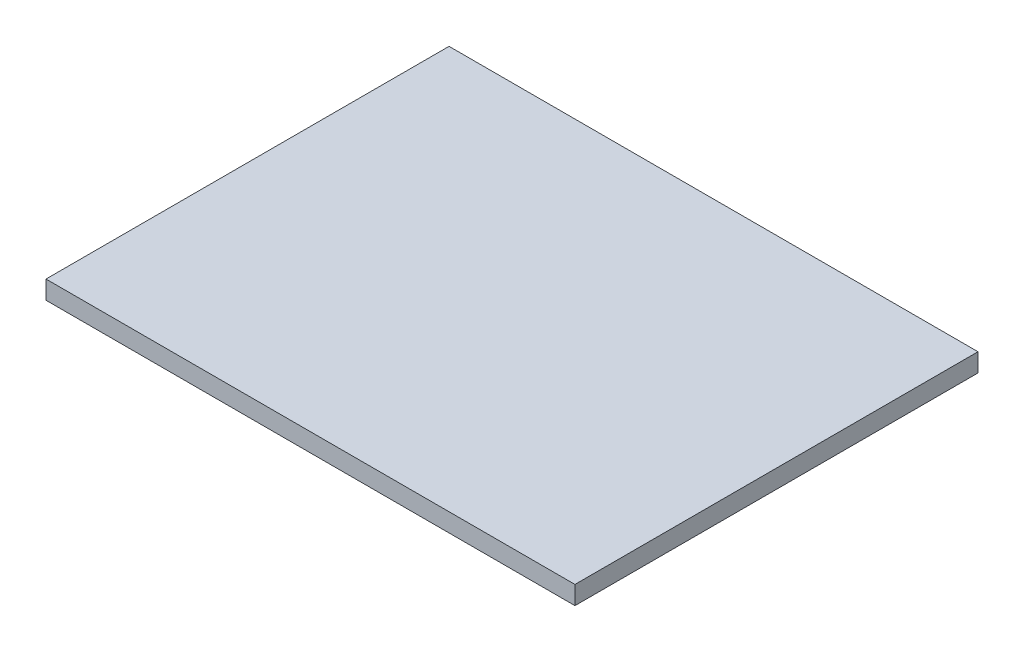
ISO-10303-21;
HEADER;
FILE_DESCRIPTION(('STEP AP214'),'2;1');
FILE_NAME('part.step','',(''),(''),'','','');
FILE_SCHEMA(('AUTOMOTIVE_DESIGN { 1 0 10303 214 1 1 1 1 }'));
ENDSEC;
DATA;
#1=APPLICATION_CONTEXT('core data for automotive mechanical design processes');
#2=APPLICATION_PROTOCOL_DEFINITION('international standard','automotive_design',2000,#1);
#3=PRODUCT_CONTEXT('',#1,'mechanical');
#4=PRODUCT('Part','Part','',(#3));
#5=PRODUCT_RELATED_PRODUCT_CATEGORY('part','',(#4));
#6=PRODUCT_DEFINITION_FORMATION('','',#4);
#7=PRODUCT_DEFINITION_CONTEXT('part definition',#1,'design');
#8=PRODUCT_DEFINITION('design','',#6,#7);
#9=PRODUCT_DEFINITION_SHAPE('','',#8);
#10=(LENGTH_UNIT() NAMED_UNIT(*) SI_UNIT(.MILLI.,.METRE.));
#11=(NAMED_UNIT(*) PLANE_ANGLE_UNIT() SI_UNIT($,.RADIAN.));
#12=(NAMED_UNIT(*) SI_UNIT($,.STERADIAN.) SOLID_ANGLE_UNIT());
#13=UNCERTAINTY_MEASURE_WITH_UNIT(LENGTH_MEASURE(1.E-05),#10,'distance_accuracy_value','');
#14=(GEOMETRIC_REPRESENTATION_CONTEXT(3) GLOBAL_UNCERTAINTY_ASSIGNED_CONTEXT((#13)) GLOBAL_UNIT_ASSIGNED_CONTEXT((#10,
#11,#12)) REPRESENTATION_CONTEXT('',''));
#15=CARTESIAN_POINT('',(0.,0.,0.));
#16=DIRECTION('',(0.,0.,1.));
#17=DIRECTION('',(1.,0.,0.));
#18=AXIS2_PLACEMENT_3D('',#15,#16,#17);
#19=CARTESIAN_POINT('',(0.,2.,0.));
#20=DIRECTION('',(1.,0.,0.));
#21=DIRECTION('',(0.,0.,-1.));
#22=AXIS2_PLACEMENT_3D('',#19,#20,#21);
#23=PLANE('',#22);
#24=DIRECTION('',(0.,0.,1.));
#25=VECTOR('',#24,1.);
#26=CARTESIAN_POINT('',(0.,-2.,0.));
#27=LINE('',#26,#25);
#28=CARTESIAN_POINT('',(0.,-2.,0.));
#29=VERTEX_POINT('',#28);
#30=CARTESIAN_POINT('',(0.,-2.,87.6253732669454));
#31=VERTEX_POINT('',#30);
#32=EDGE_CURVE('E96',#29,#31,#27,.T.);
#33=ORIENTED_EDGE('',*,*,#32,.T.);
#34=DIRECTION('',(0.,-1.,0.));
#35=VECTOR('',#34,1.);
#36=CARTESIAN_POINT('',(0.,2.,87.6253732669454));
#37=LINE('',#36,#35);
#38=CARTESIAN_POINT('',(0.,2.,87.6253732669454));
#39=VERTEX_POINT('',#38);
#40=EDGE_CURVE('E11',#39,#31,#37,.T.);
#41=ORIENTED_EDGE('',*,*,#40,.F.);
#42=DIRECTION('',(0.,0.,1.));
#43=VECTOR('',#42,1.);
#44=CARTESIAN_POINT('',(0.,2.,0.));
#45=LINE('',#44,#43);
#46=CARTESIAN_POINT('',(0.,2.,0.));
#47=VERTEX_POINT('',#46);
#48=EDGE_CURVE('E84',#47,#39,#45,.T.);
#49=ORIENTED_EDGE('',*,*,#48,.F.);
#50=DIRECTION('',(0.,-1.,0.));
#51=VECTOR('',#50,1.);
#52=CARTESIAN_POINT('',(0.,2.,0.));
#53=LINE('',#52,#51);
#54=EDGE_CURVE('E92',#47,#29,#53,.T.);
#55=ORIENTED_EDGE('',*,*,#54,.T.);
#56=EDGE_LOOP('',(#33,#41,#49,#55));
#57=FACE_BOUND('',#56,.T.);
#58=ADVANCED_FACE('F33',(#57),#23,.F.);
#59=CARTESIAN_POINT('',(0.,2.,87.6253732669454));
#60=DIRECTION('',(0.,0.,-1.));
#61=DIRECTION('',(-1.,0.,0.));
#62=AXIS2_PLACEMENT_3D('',#59,#60,#61);
#63=PLANE('',#62);
#64=DIRECTION('',(1.,0.,0.));
#65=VECTOR('',#64,1.);
#66=CARTESIAN_POINT('',(0.,-2.,87.6253732669454));
#67=LINE('',#66,#65);
#68=CARTESIAN_POINT('',(115.,-2.,87.6253732669454));
#69=VERTEX_POINT('',#68);
#70=EDGE_CURVE('E88',#31,#69,#67,.T.);
#71=ORIENTED_EDGE('',*,*,#70,.T.);
#72=DIRECTION('',(0.,-1.,0.));
#73=VECTOR('',#72,1.);
#74=CARTESIAN_POINT('',(115.,2.,87.6253732669454));
#75=LINE('',#74,#73);
#76=CARTESIAN_POINT('',(115.,2.,87.6253732669454));
#77=VERTEX_POINT('',#76);
#78=EDGE_CURVE('E41',#77,#69,#75,.T.);
#79=ORIENTED_EDGE('',*,*,#78,.F.);
#80=DIRECTION('',(1.,0.,0.));
#81=VECTOR('',#80,1.);
#82=CARTESIAN_POINT('',(0.,2.,87.6253732669454));
#83=LINE('',#82,#81);
#84=EDGE_CURVE('E79',#39,#77,#83,.T.);
#85=ORIENTED_EDGE('',*,*,#84,.F.);
#86=ORIENTED_EDGE('',*,*,#40,.T.);
#87=EDGE_LOOP('',(#71,#79,#85,#86));
#88=FACE_BOUND('',#87,.T.);
#89=ADVANCED_FACE('F87',(#88),#63,.F.);
#90=CARTESIAN_POINT('',(115.,2.,0.));
#91=DIRECTION('',(-1.,0.,0.));
#92=DIRECTION('',(0.,0.,1.));
#93=AXIS2_PLACEMENT_3D('',#90,#91,#92);
#94=PLANE('',#93);
#95=DIRECTION('',(0.,0.,-1.));
#96=VECTOR('',#95,1.);
#97=CARTESIAN_POINT('',(115.,-2.,0.));
#98=LINE('',#97,#96);
#99=CARTESIAN_POINT('',(115.,-2.,0.));
#100=VERTEX_POINT('',#99);
#101=EDGE_CURVE('E66',#69,#100,#98,.T.);
#102=ORIENTED_EDGE('',*,*,#101,.T.);
#103=DIRECTION('',(0.,-1.,0.));
#104=VECTOR('',#103,1.);
#105=CARTESIAN_POINT('',(115.,2.,0.));
#106=LINE('',#105,#104);
#107=CARTESIAN_POINT('',(115.,2.,0.));
#108=VERTEX_POINT('',#107);
#109=EDGE_CURVE('E89',#108,#100,#106,.T.);
#110=ORIENTED_EDGE('',*,*,#109,.F.);
#111=DIRECTION('',(0.,0.,-1.));
#112=VECTOR('',#111,1.);
#113=CARTESIAN_POINT('',(115.,2.,0.));
#114=LINE('',#113,#112);
#115=EDGE_CURVE('E82',#77,#108,#114,.T.);
#116=ORIENTED_EDGE('',*,*,#115,.F.);
#117=ORIENTED_EDGE('',*,*,#78,.T.);
#118=EDGE_LOOP('',(#102,#110,#116,#117));
#119=FACE_BOUND('',#118,.T.);
#120=ADVANCED_FACE('F90',(#119),#94,.F.);
#121=CARTESIAN_POINT('',(0.,2.,0.));
#122=DIRECTION('',(0.,0.,1.));
#123=DIRECTION('',(1.,0.,0.));
#124=AXIS2_PLACEMENT_3D('',#121,#122,#123);
#125=PLANE('',#124);
#126=DIRECTION('',(-1.,0.,0.));
#127=VECTOR('',#126,1.);
#128=CARTESIAN_POINT('',(0.,-2.,0.));
#129=LINE('',#128,#127);
#130=EDGE_CURVE('E72',#100,#29,#129,.T.);
#131=ORIENTED_EDGE('',*,*,#130,.T.);
#132=ORIENTED_EDGE('',*,*,#54,.F.);
#133=DIRECTION('',(-1.,0.,0.));
#134=VECTOR('',#133,1.);
#135=CARTESIAN_POINT('',(0.,2.,0.));
#136=LINE('',#135,#134);
#137=EDGE_CURVE('E49',#108,#47,#136,.T.);
#138=ORIENTED_EDGE('',*,*,#137,.F.);
#139=ORIENTED_EDGE('',*,*,#109,.T.);
#140=EDGE_LOOP('',(#131,#132,#138,#139));
#141=FACE_BOUND('',#140,.T.);
#142=ADVANCED_FACE('F103',(#141),#125,.F.);
#143=CARTESIAN_POINT('',(0.,2.,0.));
#144=DIRECTION('',(0.,1.,0.));
#145=DIRECTION('',(0.,0.,1.));
#146=AXIS2_PLACEMENT_3D('',#143,#144,#145);
#147=PLANE('',#146);
#148=ORIENTED_EDGE('',*,*,#48,.T.);
#149=ORIENTED_EDGE('',*,*,#84,.T.);
#150=ORIENTED_EDGE('',*,*,#115,.T.);
#151=ORIENTED_EDGE('',*,*,#137,.T.);
#152=EDGE_LOOP('',(#148,#149,#150,#151));
#153=FACE_BOUND('',#152,.T.);
#154=ADVANCED_FACE('F80',(#153),#147,.T.);
#155=CARTESIAN_POINT('',(0.,-2.,0.));
#156=DIRECTION('',(0.,1.,0.));
#157=DIRECTION('',(0.,0.,1.));
#158=AXIS2_PLACEMENT_3D('',#155,#156,#157);
#159=PLANE('',#158);
#160=ORIENTED_EDGE('',*,*,#32,.F.);
#161=ORIENTED_EDGE('',*,*,#130,.F.);
#162=ORIENTED_EDGE('',*,*,#101,.F.);
#163=ORIENTED_EDGE('',*,*,#70,.F.);
#164=EDGE_LOOP('',(#160,#161,#162,#163));
#165=FACE_BOUND('',#164,.T.);
#166=ADVANCED_FACE('F106',(#165),#159,.F.);
#167=CLOSED_SHELL('',(#58,#89,#120,#142,#154,#166));
#168=MANIFOLD_SOLID_BREP('B2',#167);
#169=ADVANCED_BREP_SHAPE_REPRESENTATION('',(#18,#168),#14);
#170=SHAPE_DEFINITION_REPRESENTATION(#9,#169);
ENDSEC;
END-ISO-10303-21;
